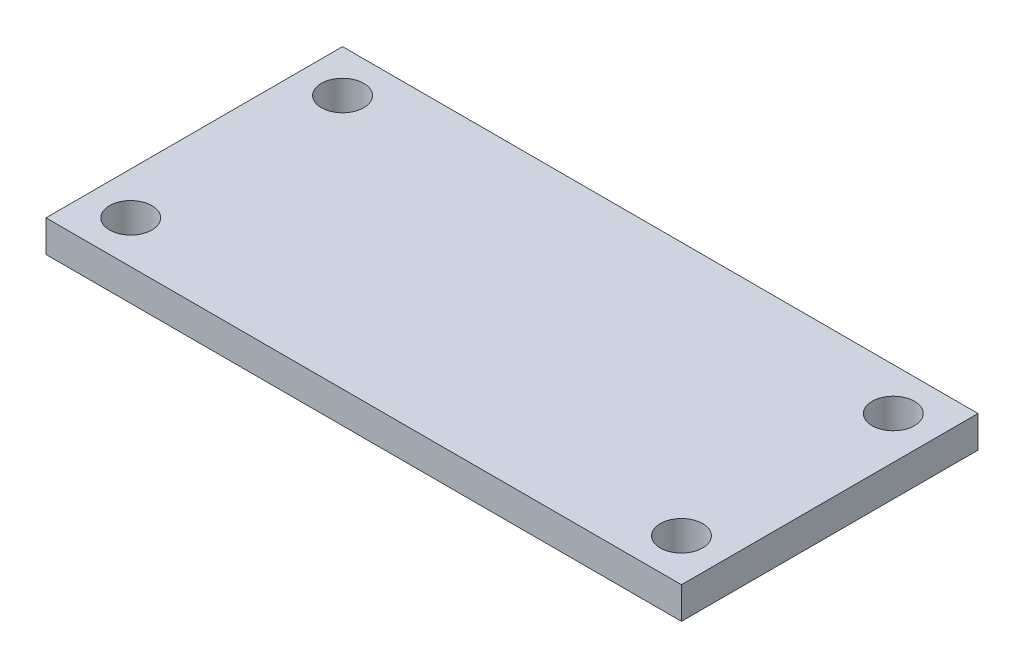
ISO-10303-21;
HEADER;
FILE_DESCRIPTION(('STEP AP214'),'2;1');
FILE_NAME('part.step','',(''),(''),'','','');
FILE_SCHEMA(('AUTOMOTIVE_DESIGN { 1 0 10303 214 1 1 1 1 }'));
ENDSEC;
DATA;
#1=APPLICATION_CONTEXT('core data for automotive mechanical design processes');
#2=APPLICATION_PROTOCOL_DEFINITION('international standard','automotive_design',2000,#1);
#3=PRODUCT_CONTEXT('',#1,'mechanical');
#4=PRODUCT('Part','Part','',(#3));
#5=PRODUCT_RELATED_PRODUCT_CATEGORY('part','',(#4));
#6=PRODUCT_DEFINITION_FORMATION('','',#4);
#7=PRODUCT_DEFINITION_CONTEXT('part definition',#1,'design');
#8=PRODUCT_DEFINITION('design','',#6,#7);
#9=PRODUCT_DEFINITION_SHAPE('','',#8);
#10=(LENGTH_UNIT() NAMED_UNIT(*) SI_UNIT(.MILLI.,.METRE.));
#11=(NAMED_UNIT(*) PLANE_ANGLE_UNIT() SI_UNIT($,.RADIAN.));
#12=(NAMED_UNIT(*) SI_UNIT($,.STERADIAN.) SOLID_ANGLE_UNIT());
#13=UNCERTAINTY_MEASURE_WITH_UNIT(LENGTH_MEASURE(1.E-05),#10,'distance_accuracy_value','');
#14=(GEOMETRIC_REPRESENTATION_CONTEXT(3) GLOBAL_UNCERTAINTY_ASSIGNED_CONTEXT((#13)) GLOBAL_UNIT_ASSIGNED_CONTEXT((#10,
#11,#12)) REPRESENTATION_CONTEXT('',''));
#15=CARTESIAN_POINT('',(0.,0.,0.));
#16=DIRECTION('',(0.,0.,1.));
#17=DIRECTION('',(1.,0.,0.));
#18=AXIS2_PLACEMENT_3D('',#15,#16,#17);
#19=CARTESIAN_POINT('',(0.,3.,0.));
#20=DIRECTION('',(1.,0.,0.));
#21=DIRECTION('',(0.,0.,-1.));
#22=AXIS2_PLACEMENT_3D('',#19,#20,#21);
#23=PLANE('',#22);
#24=DIRECTION('',(0.,0.,1.));
#25=VECTOR('',#24,1.);
#26=CARTESIAN_POINT('',(0.,0.,0.));
#27=LINE('',#26,#25);
#28=CARTESIAN_POINT('',(0.,0.,-28.));
#29=VERTEX_POINT('',#28);
#30=CARTESIAN_POINT('',(0.,0.,0.));
#31=VERTEX_POINT('',#30);
#32=EDGE_CURVE('E96',#29,#31,#27,.T.);
#33=ORIENTED_EDGE('',*,*,#32,.T.);
#34=DIRECTION('',(0.,-1.,0.));
#35=VECTOR('',#34,1.);
#36=CARTESIAN_POINT('',(0.,3.,0.));
#37=LINE('',#36,#35);
#38=CARTESIAN_POINT('',(0.,3.,0.));
#39=VERTEX_POINT('',#38);
#40=EDGE_CURVE('E11',#39,#31,#37,.T.);
#41=ORIENTED_EDGE('',*,*,#40,.F.);
#42=DIRECTION('',(0.,0.,1.));
#43=VECTOR('',#42,1.);
#44=CARTESIAN_POINT('',(0.,3.,0.));
#45=LINE('',#44,#43);
#46=CARTESIAN_POINT('',(0.,3.,-28.));
#47=VERTEX_POINT('',#46);
#48=EDGE_CURVE('E84',#47,#39,#45,.T.);
#49=ORIENTED_EDGE('',*,*,#48,.F.);
#50=DIRECTION('',(0.,-1.,0.));
#51=VECTOR('',#50,1.);
#52=CARTESIAN_POINT('',(0.,3.,-28.));
#53=LINE('',#52,#51);
#54=EDGE_CURVE('E92',#47,#29,#53,.T.);
#55=ORIENTED_EDGE('',*,*,#54,.T.);
#56=EDGE_LOOP('',(#33,#41,#49,#55));
#57=FACE_BOUND('',#56,.T.);
#58=ADVANCED_FACE('F33',(#57),#23,.F.);
#59=CARTESIAN_POINT('',(0.,3.,0.));
#60=DIRECTION('',(0.,0.,-1.));
#61=DIRECTION('',(-1.,0.,0.));
#62=AXIS2_PLACEMENT_3D('',#59,#60,#61);
#63=PLANE('',#62);
#64=DIRECTION('',(1.,0.,0.));
#65=VECTOR('',#64,1.);
#66=CARTESIAN_POINT('',(0.,0.,0.));
#67=LINE('',#66,#65);
#68=CARTESIAN_POINT('',(60.,0.,0.));
#69=VERTEX_POINT('',#68);
#70=EDGE_CURVE('E88',#31,#69,#67,.T.);
#71=ORIENTED_EDGE('',*,*,#70,.T.);
#72=DIRECTION('',(0.,-1.,0.));
#73=VECTOR('',#72,1.);
#74=CARTESIAN_POINT('',(60.,3.,0.));
#75=LINE('',#74,#73);
#76=CARTESIAN_POINT('',(60.,3.,0.));
#77=VERTEX_POINT('',#76);
#78=EDGE_CURVE('E41',#77,#69,#75,.T.);
#79=ORIENTED_EDGE('',*,*,#78,.F.);
#80=DIRECTION('',(1.,0.,0.));
#81=VECTOR('',#80,1.);
#82=CARTESIAN_POINT('',(0.,3.,0.));
#83=LINE('',#82,#81);
#84=EDGE_CURVE('E79',#39,#77,#83,.T.);
#85=ORIENTED_EDGE('',*,*,#84,.F.);
#86=ORIENTED_EDGE('',*,*,#40,.T.);
#87=EDGE_LOOP('',(#71,#79,#85,#86));
#88=FACE_BOUND('',#87,.T.);
#89=ADVANCED_FACE('F87',(#88),#63,.F.);
#90=CARTESIAN_POINT('',(60.,3.,0.));
#91=DIRECTION('',(-1.,0.,0.));
#92=DIRECTION('',(0.,0.,1.));
#93=AXIS2_PLACEMENT_3D('',#90,#91,#92);
#94=PLANE('',#93);
#95=DIRECTION('',(0.,0.,-1.));
#96=VECTOR('',#95,1.);
#97=CARTESIAN_POINT('',(60.,0.,0.));
#98=LINE('',#97,#96);
#99=CARTESIAN_POINT('',(60.,0.,-28.));
#100=VERTEX_POINT('',#99);
#101=EDGE_CURVE('E66',#69,#100,#98,.T.);
#102=ORIENTED_EDGE('',*,*,#101,.T.);
#103=DIRECTION('',(0.,-1.,0.));
#104=VECTOR('',#103,1.);
#105=CARTESIAN_POINT('',(60.,3.,-28.));
#106=LINE('',#105,#104);
#107=CARTESIAN_POINT('',(60.,3.,-28.));
#108=VERTEX_POINT('',#107);
#109=EDGE_CURVE('E89',#108,#100,#106,.T.);
#110=ORIENTED_EDGE('',*,*,#109,.F.);
#111=DIRECTION('',(0.,0.,-1.));
#112=VECTOR('',#111,1.);
#113=CARTESIAN_POINT('',(60.,3.,0.));
#114=LINE('',#113,#112);
#115=EDGE_CURVE('E82',#77,#108,#114,.T.);
#116=ORIENTED_EDGE('',*,*,#115,.F.);
#117=ORIENTED_EDGE('',*,*,#78,.T.);
#118=EDGE_LOOP('',(#102,#110,#116,#117));
#119=FACE_BOUND('',#118,.T.);
#120=ADVANCED_FACE('F90',(#119),#94,.F.);
#121=CARTESIAN_POINT('',(0.,3.,-28.));
#122=DIRECTION('',(0.,0.,1.));
#123=DIRECTION('',(1.,0.,0.));
#124=AXIS2_PLACEMENT_3D('',#121,#122,#123);
#125=PLANE('',#124);
#126=DIRECTION('',(-1.,0.,0.));
#127=VECTOR('',#126,1.);
#128=CARTESIAN_POINT('',(0.,0.,-28.));
#129=LINE('',#128,#127);
#130=EDGE_CURVE('E72',#100,#29,#129,.T.);
#131=ORIENTED_EDGE('',*,*,#130,.T.);
#132=ORIENTED_EDGE('',*,*,#54,.F.);
#133=DIRECTION('',(-1.,0.,0.));
#134=VECTOR('',#133,1.);
#135=CARTESIAN_POINT('',(0.,3.,-28.));
#136=LINE('',#135,#134);
#137=EDGE_CURVE('E49',#108,#47,#136,.T.);
#138=ORIENTED_EDGE('',*,*,#137,.F.);
#139=ORIENTED_EDGE('',*,*,#109,.T.);
#140=EDGE_LOOP('',(#131,#132,#138,#139));
#141=FACE_BOUND('',#140,.T.);
#142=ADVANCED_FACE('F104',(#141),#125,.F.);
#143=CARTESIAN_POINT('',(0.,3.,0.));
#144=DIRECTION('',(0.,-1.,0.));
#145=DIRECTION('',(0.,0.,-1.));
#146=AXIS2_PLACEMENT_3D('',#143,#144,#145);
#147=PLANE('',#146);
#148=CARTESIAN_POINT('',(56.,3.,-4.));
#149=DIRECTION('',(0.,1.,0.));
#150=DIRECTION('',(0.,0.,1.));
#151=AXIS2_PLACEMENT_3D('',#148,#149,#150);
#152=CIRCLE('',#151,2.);
#153=CARTESIAN_POINT('',(56.,3.,-2.));
#154=VERTEX_POINT('',#153);
#155=EDGE_CURVE('E128',#154,#154,#152,.T.);
#156=ORIENTED_EDGE('',*,*,#155,.F.);
#157=EDGE_LOOP('',(#156));
#158=FACE_BOUND('',#157,.T.);
#159=CARTESIAN_POINT('',(56.,3.,-24.));
#160=DIRECTION('',(0.,1.,0.));
#161=DIRECTION('',(0.,0.,1.));
#162=AXIS2_PLACEMENT_3D('',#159,#160,#161);
#163=CIRCLE('',#162,2.);
#164=CARTESIAN_POINT('',(56.,3.,-22.));
#165=VERTEX_POINT('',#164);
#166=EDGE_CURVE('E122',#165,#165,#163,.T.);
#167=ORIENTED_EDGE('',*,*,#166,.F.);
#168=EDGE_LOOP('',(#167));
#169=FACE_BOUND('',#168,.T.);
#170=CARTESIAN_POINT('',(4.,3.,-24.));
#171=DIRECTION('',(0.,1.,0.));
#172=DIRECTION('',(0.,0.,1.));
#173=AXIS2_PLACEMENT_3D('',#170,#171,#172);
#174=CIRCLE('',#173,2.);
#175=CARTESIAN_POINT('',(4.,3.,-22.));
#176=VERTEX_POINT('',#175);
#177=EDGE_CURVE('E116',#176,#176,#174,.T.);
#178=ORIENTED_EDGE('',*,*,#177,.F.);
#179=EDGE_LOOP('',(#178));
#180=FACE_BOUND('',#179,.T.);
#181=CARTESIAN_POINT('',(4.,3.,-4.));
#182=DIRECTION('',(0.,1.,0.));
#183=DIRECTION('',(0.,0.,1.));
#184=AXIS2_PLACEMENT_3D('',#181,#182,#183);
#185=CIRCLE('',#184,2.);
#186=CARTESIAN_POINT('',(4.,3.,-2.));
#187=VERTEX_POINT('',#186);
#188=EDGE_CURVE('E110',#187,#187,#185,.T.);
#189=ORIENTED_EDGE('',*,*,#188,.F.);
#190=EDGE_LOOP('',(#189));
#191=FACE_BOUND('',#190,.T.);
#192=ORIENTED_EDGE('',*,*,#48,.T.);
#193=ORIENTED_EDGE('',*,*,#84,.T.);
#194=ORIENTED_EDGE('',*,*,#115,.T.);
#195=ORIENTED_EDGE('',*,*,#137,.T.);
#196=EDGE_LOOP('',(#192,#193,#194,#195));
#197=FACE_BOUND('',#196,.T.);
#198=ADVANCED_FACE('F80',(#158,#169,#180,#191,#197),#147,.F.);
#199=CARTESIAN_POINT('',(0.,0.,0.));
#200=DIRECTION('',(0.,-1.,0.));
#201=DIRECTION('',(0.,0.,-1.));
#202=AXIS2_PLACEMENT_3D('',#199,#200,#201);
#203=PLANE('',#202);
#204=CARTESIAN_POINT('',(56.,0.,-4.));
#205=DIRECTION('',(0.,1.,0.));
#206=DIRECTION('',(0.,0.,1.));
#207=AXIS2_PLACEMENT_3D('',#204,#205,#206);
#208=CIRCLE('',#207,2.);
#209=CARTESIAN_POINT('',(56.,0.,-2.));
#210=VERTEX_POINT('',#209);
#211=EDGE_CURVE('E125',#210,#210,#208,.T.);
#212=ORIENTED_EDGE('',*,*,#211,.T.);
#213=EDGE_LOOP('',(#212));
#214=FACE_BOUND('',#213,.T.);
#215=CARTESIAN_POINT('',(56.,0.,-24.));
#216=DIRECTION('',(0.,1.,0.));
#217=DIRECTION('',(0.,0.,1.));
#218=AXIS2_PLACEMENT_3D('',#215,#216,#217);
#219=CIRCLE('',#218,2.);
#220=CARTESIAN_POINT('',(56.,0.,-22.));
#221=VERTEX_POINT('',#220);
#222=EDGE_CURVE('E119',#221,#221,#219,.T.);
#223=ORIENTED_EDGE('',*,*,#222,.T.);
#224=EDGE_LOOP('',(#223));
#225=FACE_BOUND('',#224,.T.);
#226=CARTESIAN_POINT('',(4.,0.,-24.));
#227=DIRECTION('',(0.,1.,0.));
#228=DIRECTION('',(0.,0.,1.));
#229=AXIS2_PLACEMENT_3D('',#226,#227,#228);
#230=CIRCLE('',#229,2.);
#231=CARTESIAN_POINT('',(4.,0.,-22.));
#232=VERTEX_POINT('',#231);
#233=EDGE_CURVE('E113',#232,#232,#230,.T.);
#234=ORIENTED_EDGE('',*,*,#233,.T.);
#235=EDGE_LOOP('',(#234));
#236=FACE_BOUND('',#235,.T.);
#237=CARTESIAN_POINT('',(4.,0.,-4.));
#238=DIRECTION('',(0.,1.,0.));
#239=DIRECTION('',(0.,0.,1.));
#240=AXIS2_PLACEMENT_3D('',#237,#238,#239);
#241=CIRCLE('',#240,2.);
#242=CARTESIAN_POINT('',(4.,0.,-2.));
#243=VERTEX_POINT('',#242);
#244=EDGE_CURVE('E99',#243,#243,#241,.T.);
#245=ORIENTED_EDGE('',*,*,#244,.T.);
#246=EDGE_LOOP('',(#245));
#247=FACE_BOUND('',#246,.T.);
#248=ORIENTED_EDGE('',*,*,#32,.F.);
#249=ORIENTED_EDGE('',*,*,#130,.F.);
#250=ORIENTED_EDGE('',*,*,#101,.F.);
#251=ORIENTED_EDGE('',*,*,#70,.F.);
#252=EDGE_LOOP('',(#248,#249,#250,#251));
#253=FACE_BOUND('',#252,.T.);
#254=ADVANCED_FACE('F107',(#214,#225,#236,#247,#253),#203,.T.);
#255=CARTESIAN_POINT('',(4.,0.,-4.));
#256=DIRECTION('',(0.,1.,0.));
#257=DIRECTION('',(0.,0.,1.));
#258=AXIS2_PLACEMENT_3D('',#255,#256,#257);
#259=CYLINDRICAL_SURFACE('',#258,2.);
#260=ORIENTED_EDGE('',*,*,#244,.F.);
#261=EDGE_LOOP('',(#260));
#262=FACE_BOUND('',#261,.T.);
#263=ORIENTED_EDGE('',*,*,#188,.T.);
#264=EDGE_LOOP('',(#263));
#265=FACE_BOUND('',#264,.T.);
#266=ADVANCED_FACE('F152',(#262,#265),#259,.F.);
#267=CARTESIAN_POINT('',(4.,0.,-24.));
#268=DIRECTION('',(0.,1.,0.));
#269=DIRECTION('',(0.,0.,1.));
#270=AXIS2_PLACEMENT_3D('',#267,#268,#269);
#271=CYLINDRICAL_SURFACE('',#270,2.);
#272=ORIENTED_EDGE('',*,*,#233,.F.);
#273=EDGE_LOOP('',(#272));
#274=FACE_BOUND('',#273,.T.);
#275=ORIENTED_EDGE('',*,*,#177,.T.);
#276=EDGE_LOOP('',(#275));
#277=FACE_BOUND('',#276,.T.);
#278=ADVANCED_FACE('F154',(#274,#277),#271,.F.);
#279=CARTESIAN_POINT('',(56.,0.,-24.));
#280=DIRECTION('',(0.,1.,0.));
#281=DIRECTION('',(0.,0.,1.));
#282=AXIS2_PLACEMENT_3D('',#279,#280,#281);
#283=CYLINDRICAL_SURFACE('',#282,2.);
#284=ORIENTED_EDGE('',*,*,#222,.F.);
#285=EDGE_LOOP('',(#284));
#286=FACE_BOUND('',#285,.T.);
#287=ORIENTED_EDGE('',*,*,#166,.T.);
#288=EDGE_LOOP('',(#287));
#289=FACE_BOUND('',#288,.T.);
#290=ADVANCED_FACE('F139',(#286,#289),#283,.F.);
#291=CARTESIAN_POINT('',(56.,0.,-4.));
#292=DIRECTION('',(0.,1.,0.));
#293=DIRECTION('',(0.,0.,1.));
#294=AXIS2_PLACEMENT_3D('',#291,#292,#293);
#295=CYLINDRICAL_SURFACE('',#294,2.);
#296=ORIENTED_EDGE('',*,*,#211,.F.);
#297=EDGE_LOOP('',(#296));
#298=FACE_BOUND('',#297,.T.);
#299=ORIENTED_EDGE('',*,*,#155,.T.);
#300=EDGE_LOOP('',(#299));
#301=FACE_BOUND('',#300,.T.);
#302=ADVANCED_FACE('F136',(#298,#301),#295,.F.);
#303=CLOSED_SHELL('',(#58,#89,#120,#142,#198,#254,#266,#278,#290,#302));
#304=MANIFOLD_SOLID_BREP('B2',#303);
#305=ADVANCED_BREP_SHAPE_REPRESENTATION('',(#18,#304),#14);
#306=SHAPE_DEFINITION_REPRESENTATION(#9,#305);
ENDSEC;
END-ISO-10303-21;
